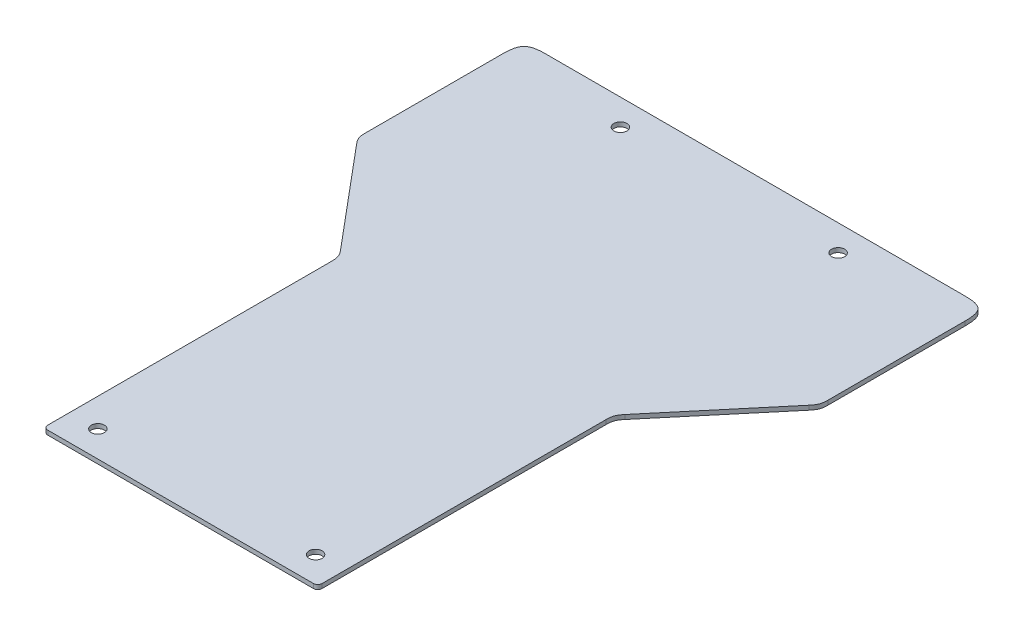
ISO-10303-21;
HEADER;
FILE_DESCRIPTION(('STEP AP214'),'2;1');
FILE_NAME('part.step','',(''),(''),'','','');
FILE_SCHEMA(('AUTOMOTIVE_DESIGN { 1 0 10303 214 1 1 1 1 }'));
ENDSEC;
DATA;
#1=APPLICATION_CONTEXT('core data for automotive mechanical design processes');
#2=APPLICATION_PROTOCOL_DEFINITION('international standard','automotive_design',2000,#1);
#3=PRODUCT_CONTEXT('',#1,'mechanical');
#4=PRODUCT('Part','Part','',(#3));
#5=PRODUCT_RELATED_PRODUCT_CATEGORY('part','',(#4));
#6=PRODUCT_DEFINITION_FORMATION('','',#4);
#7=PRODUCT_DEFINITION_CONTEXT('part definition',#1,'design');
#8=PRODUCT_DEFINITION('design','',#6,#7);
#9=PRODUCT_DEFINITION_SHAPE('','',#8);
#10=(LENGTH_UNIT() NAMED_UNIT(*) SI_UNIT(.MILLI.,.METRE.));
#11=(NAMED_UNIT(*) PLANE_ANGLE_UNIT() SI_UNIT($,.RADIAN.));
#12=(NAMED_UNIT(*) SI_UNIT($,.STERADIAN.) SOLID_ANGLE_UNIT());
#13=UNCERTAINTY_MEASURE_WITH_UNIT(LENGTH_MEASURE(1.E-05),#10,'distance_accuracy_value','');
#14=(GEOMETRIC_REPRESENTATION_CONTEXT(3) GLOBAL_UNCERTAINTY_ASSIGNED_CONTEXT((#13)) GLOBAL_UNIT_ASSIGNED_CONTEXT((#10,
#11,#12)) REPRESENTATION_CONTEXT('',''));
#15=CARTESIAN_POINT('',(0.,0.,0.));
#16=DIRECTION('',(0.,0.,1.));
#17=DIRECTION('',(1.,0.,0.));
#18=AXIS2_PLACEMENT_3D('',#15,#16,#17);
#19=CARTESIAN_POINT('',(-106.25,2.,56.));
#20=DIRECTION('',(-1.,0.,0.));
#21=DIRECTION('',(0.,0.,1.));
#22=AXIS2_PLACEMENT_3D('',#19,#20,#21);
#23=PLANE('',#22);
#24=DIRECTION('',(0.,0.,-1.));
#25=VECTOR('',#24,1.);
#26=CARTESIAN_POINT('',(-106.25,2.,56.));
#27=LINE('',#26,#25);
#28=CARTESIAN_POINT('',(-106.25,2.,14.8169547776392));
#29=VERTEX_POINT('',#28);
#30=CARTESIAN_POINT('',(-106.25,2.,-48.));
#31=VERTEX_POINT('',#30);
#32=EDGE_CURVE('E198',#29,#31,#27,.T.);
#33=ORIENTED_EDGE('',*,*,#32,.T.);
#34=CARTESIAN_POINT('',(-106.25,-0.1,-48.));
#35=CARTESIAN_POINT('',(-106.25,0.633333333333333,-48.));
#36=CARTESIAN_POINT('',(-106.25,1.36666666666667,-48.));
#37=CARTESIAN_POINT('',(-106.25,2.1,-48.));
#38=(BOUNDED_CURVE() B_SPLINE_CURVE(3,(#34,#35,#36,#37),.UNSPECIFIED.,.F.,
.F.) B_SPLINE_CURVE_WITH_KNOTS((4,4),(-9.99999999999998E-05,0.0021),
.UNSPECIFIED.) CURVE() GEOMETRIC_REPRESENTATION_ITEM() RATIONAL_B_SPLINE_CURVE((1.,1.,1.,1.)) REPRESENTATION_ITEM(''));
#39=CARTESIAN_POINT('',(-106.25,0.,-48.));
#40=VERTEX_POINT('',#39);
#41=EDGE_CURVE('E403',#31,#40,#38,.F.);
#42=ORIENTED_EDGE('',*,*,#41,.T.);
#43=DIRECTION('',(0.,0.,-1.));
#44=VECTOR('',#43,1.);
#45=CARTESIAN_POINT('',(-106.25,0.,56.));
#46=LINE('',#45,#44);
#47=CARTESIAN_POINT('',(-106.25,0.,14.8169547776392));
#48=VERTEX_POINT('',#47);
#49=EDGE_CURVE('E199',#48,#40,#46,.T.);
#50=ORIENTED_EDGE('',*,*,#49,.F.);
#51=CARTESIAN_POINT('',(-106.25,2.1,14.8169547776392));
#52=CARTESIAN_POINT('',(-106.25,1.36666666666667,14.8169547776392));
#53=CARTESIAN_POINT('',(-106.25,0.633333333333334,14.8169547776392));
#54=CARTESIAN_POINT('',(-106.25,-0.0999999999999998,14.8169547776392));
#55=(BOUNDED_CURVE() B_SPLINE_CURVE(3,(#51,#52,#53,#54),.UNSPECIFIED.,.F.,
.F.) B_SPLINE_CURVE_WITH_KNOTS((4,4),(-0.0021,9.99999999999998E-05),
.UNSPECIFIED.) CURVE() GEOMETRIC_REPRESENTATION_ITEM() RATIONAL_B_SPLINE_CURVE((1.,1.,1.,1.)) REPRESENTATION_ITEM(''));
#56=EDGE_CURVE('E619',#48,#29,#55,.F.);
#57=ORIENTED_EDGE('',*,*,#56,.T.);
#58=EDGE_LOOP('',(#33,#42,#50,#57));
#59=FACE_BOUND('',#58,.T.);
#60=ADVANCED_FACE('F49',(#59),#23,.T.);
#61=CARTESIAN_POINT('',(-134.25,2.,-58.));
#62=DIRECTION('',(0.,0.,-1.));
#63=DIRECTION('',(-1.,0.,0.));
#64=AXIS2_PLACEMENT_3D('',#61,#62,#63);
#65=PLANE('',#64);
#66=DIRECTION('',(1.,0.,0.));
#67=VECTOR('',#66,1.);
#68=CARTESIAN_POINT('',(-134.25,2.,-58.));
#69=LINE('',#68,#67);
#70=CARTESIAN_POINT('',(-96.25,2.,-58.));
#71=VERTEX_POINT('',#70);
#72=CARTESIAN_POINT('',(96.25,2.,-58.));
#73=VERTEX_POINT('',#72);
#74=EDGE_CURVE('E782',#71,#73,#69,.T.);
#75=ORIENTED_EDGE('',*,*,#74,.T.);
#76=CARTESIAN_POINT('',(96.25,-0.1,-58.));
#77=CARTESIAN_POINT('',(96.25,0.633333333333333,-58.));
#78=CARTESIAN_POINT('',(96.25,1.36666666666667,-58.));
#79=CARTESIAN_POINT('',(96.25,2.1,-58.));
#80=(BOUNDED_CURVE() B_SPLINE_CURVE(3,(#76,#77,#78,#79),.UNSPECIFIED.,.F.,
.F.) B_SPLINE_CURVE_WITH_KNOTS((4,4),(-9.99999999999998E-05,0.0021),
.UNSPECIFIED.) CURVE() GEOMETRIC_REPRESENTATION_ITEM() RATIONAL_B_SPLINE_CURVE((1.,1.,1.,1.)) REPRESENTATION_ITEM(''));
#81=CARTESIAN_POINT('',(96.25,0.,-58.));
#82=VERTEX_POINT('',#81);
#83=EDGE_CURVE('E686',#73,#82,#80,.F.);
#84=ORIENTED_EDGE('',*,*,#83,.T.);
#85=DIRECTION('',(1.,0.,0.));
#86=VECTOR('',#85,1.);
#87=CARTESIAN_POINT('',(-134.25,0.,-58.));
#88=LINE('',#87,#86);
#89=CARTESIAN_POINT('',(-96.25,0.,-58.));
#90=VERTEX_POINT('',#89);
#91=EDGE_CURVE('E784',#90,#82,#88,.T.);
#92=ORIENTED_EDGE('',*,*,#91,.F.);
#93=CARTESIAN_POINT('',(-96.25,2.1,-58.));
#94=CARTESIAN_POINT('',(-96.25,1.36666666666667,-58.));
#95=CARTESIAN_POINT('',(-96.25,0.633333333333333,-58.));
#96=CARTESIAN_POINT('',(-96.25,-0.1,-58.));
#97=(BOUNDED_CURVE() B_SPLINE_CURVE(3,(#93,#94,#95,#96),.UNSPECIFIED.,.F.,
.F.) B_SPLINE_CURVE_WITH_KNOTS((4,4),(-0.0001,0.0021),
.UNSPECIFIED.) CURVE() GEOMETRIC_REPRESENTATION_ITEM() RATIONAL_B_SPLINE_CURVE((1.,1.,1.,1.)) REPRESENTATION_ITEM(''));
#98=EDGE_CURVE('E426',#90,#71,#97,.F.);
#99=ORIENTED_EDGE('',*,*,#98,.T.);
#100=EDGE_LOOP('',(#75,#84,#92,#99));
#101=FACE_BOUND('',#100,.T.);
#102=ADVANCED_FACE('F715',(#101),#65,.T.);
#103=CARTESIAN_POINT('',(106.25,2.,-56.));
#104=DIRECTION('',(1.,0.,0.));
#105=DIRECTION('',(0.,1.,0.));
#106=AXIS2_PLACEMENT_3D('',#103,#104,#105);
#107=PLANE('',#106);
#108=DIRECTION('',(0.,0.,1.));
#109=VECTOR('',#108,1.);
#110=CARTESIAN_POINT('',(106.25,0.,56.));
#111=LINE('',#110,#109);
#112=CARTESIAN_POINT('',(106.25,0.,-48.));
#113=VERTEX_POINT('',#112);
#114=CARTESIAN_POINT('',(106.25,0.,14.8169547776392));
#115=VERTEX_POINT('',#114);
#116=EDGE_CURVE('E120',#113,#115,#111,.T.);
#117=ORIENTED_EDGE('',*,*,#116,.F.);
#118=CARTESIAN_POINT('',(106.25,2.1,-48.));
#119=CARTESIAN_POINT('',(106.25,1.36666666666667,-48.));
#120=CARTESIAN_POINT('',(106.25,0.633333333333333,-48.));
#121=CARTESIAN_POINT('',(106.25,-0.1,-48.));
#122=(BOUNDED_CURVE() B_SPLINE_CURVE(3,(#118,#119,#120,#121),.UNSPECIFIED.,.F.,
.F.) B_SPLINE_CURVE_WITH_KNOTS((4,4),(-0.0001,0.0021),
.UNSPECIFIED.) CURVE() GEOMETRIC_REPRESENTATION_ITEM() RATIONAL_B_SPLINE_CURVE((1.,1.,1.,1.)) REPRESENTATION_ITEM(''));
#123=CARTESIAN_POINT('',(106.25,2.,-48.));
#124=VERTEX_POINT('',#123);
#125=EDGE_CURVE('E375',#113,#124,#122,.F.);
#126=ORIENTED_EDGE('',*,*,#125,.T.);
#127=DIRECTION('',(0.,0.,1.));
#128=VECTOR('',#127,1.);
#129=CARTESIAN_POINT('',(106.25,2.,56.));
#130=LINE('',#129,#128);
#131=CARTESIAN_POINT('',(106.25,2.,14.8169547776392));
#132=VERTEX_POINT('',#131);
#133=EDGE_CURVE('E224',#124,#132,#130,.T.);
#134=ORIENTED_EDGE('',*,*,#133,.T.);
#135=CARTESIAN_POINT('',(106.25,-0.1,14.8169547776392));
#136=CARTESIAN_POINT('',(106.25,0.633333333333333,14.8169547776392));
#137=CARTESIAN_POINT('',(106.25,1.36666666666667,14.8169547776392));
#138=CARTESIAN_POINT('',(106.25,2.1,14.8169547776392));
#139=(BOUNDED_CURVE() B_SPLINE_CURVE(3,(#135,#136,#137,#138),.UNSPECIFIED.,.F.,
.F.) B_SPLINE_CURVE_WITH_KNOTS((4,4),(-9.99999999999998E-05,0.0021),
.UNSPECIFIED.) CURVE() GEOMETRIC_REPRESENTATION_ITEM() RATIONAL_B_SPLINE_CURVE((1.,1.,1.,1.)) REPRESENTATION_ITEM(''));
#140=EDGE_CURVE('E678',#132,#115,#139,.F.);
#141=ORIENTED_EDGE('',*,*,#140,.T.);
#142=EDGE_LOOP('',(#117,#126,#134,#141));
#143=FACE_BOUND('',#142,.T.);
#144=ADVANCED_FACE('F720',(#143),#107,.T.);
#145=CARTESIAN_POINT('',(63.,2.,98.));
#146=DIRECTION('',(1.,0.,0.));
#147=DIRECTION('',(0.,1.,0.));
#148=AXIS2_PLACEMENT_3D('',#145,#146,#147);
#149=PLANE('',#148);
#150=DIRECTION('',(0.,0.,1.));
#151=VECTOR('',#150,1.);
#152=CARTESIAN_POINT('',(63.,0.,98.));
#153=LINE('',#152,#151);
#154=CARTESIAN_POINT('',(63.,0.,73.6397023426624));
#155=VERTEX_POINT('',#154);
#156=CARTESIAN_POINT('',(63.,0.,204.));
#157=VERTEX_POINT('',#156);
#158=EDGE_CURVE('E108',#155,#157,#153,.T.);
#159=ORIENTED_EDGE('',*,*,#158,.F.);
#160=CARTESIAN_POINT('',(63.,2.1,73.6397023426624));
#161=CARTESIAN_POINT('',(63.,1.36666666666667,73.6397023426624));
#162=CARTESIAN_POINT('',(63.,0.633333333333333,73.6397023426624));
#163=CARTESIAN_POINT('',(63.,-0.1,73.6397023426624));
#164=(BOUNDED_CURVE() B_SPLINE_CURVE(3,(#160,#161,#162,#163),.UNSPECIFIED.,.F.,
.F.) B_SPLINE_CURVE_WITH_KNOTS((4,4),(-0.0001,0.0021),
.UNSPECIFIED.) CURVE() GEOMETRIC_REPRESENTATION_ITEM() RATIONAL_B_SPLINE_CURVE((1.,1.,1.,1.)) REPRESENTATION_ITEM(''));
#165=CARTESIAN_POINT('',(63.,2.,73.6397023426624));
#166=VERTEX_POINT('',#165);
#167=EDGE_CURVE('E511',#155,#166,#164,.F.);
#168=ORIENTED_EDGE('',*,*,#167,.T.);
#169=DIRECTION('',(0.,0.,1.));
#170=VECTOR('',#169,1.);
#171=CARTESIAN_POINT('',(63.,2.,98.));
#172=LINE('',#171,#170);
#173=CARTESIAN_POINT('',(63.,2.,204.));
#174=VERTEX_POINT('',#173);
#175=EDGE_CURVE('E99',#166,#174,#172,.T.);
#176=ORIENTED_EDGE('',*,*,#175,.T.);
#177=DIRECTION('',(0.,-1.,0.));
#178=VECTOR('',#177,1.);
#179=CARTESIAN_POINT('',(63.,2.,204.));
#180=LINE('',#179,#178);
#181=EDGE_CURVE('E122',#174,#157,#180,.T.);
#182=ORIENTED_EDGE('',*,*,#181,.T.);
#183=EDGE_LOOP('',(#159,#168,#176,#182));
#184=FACE_BOUND('',#183,.T.);
#185=ADVANCED_FACE('F123',(#184),#149,.T.);
#186=CARTESIAN_POINT('',(61.,2.,204.));
#187=DIRECTION('',(0.,-1.,0.));
#188=DIRECTION('',(0.,0.,-1.));
#189=AXIS2_PLACEMENT_3D('',#186,#187,#188);
#190=CYLINDRICAL_SURFACE('',#189,2.);
#191=CARTESIAN_POINT('',(61.,0.,204.));
#192=DIRECTION('',(0.,-1.,0.));
#193=DIRECTION('',(1.,0.,0.));
#194=AXIS2_PLACEMENT_3D('',#191,#192,#193);
#195=CIRCLE('',#194,2.);
#196=CARTESIAN_POINT('',(61.,0.,206.));
#197=VERTEX_POINT('',#196);
#198=EDGE_CURVE('E112',#157,#197,#195,.T.);
#199=ORIENTED_EDGE('',*,*,#198,.F.);
#200=ORIENTED_EDGE('',*,*,#181,.F.);
#201=CARTESIAN_POINT('',(61.,2.,204.));
#202=DIRECTION('',(0.,-1.,0.));
#203=DIRECTION('',(1.,0.,0.));
#204=AXIS2_PLACEMENT_3D('',#201,#202,#203);
#205=CIRCLE('',#204,2.);
#206=CARTESIAN_POINT('',(61.,2.,206.));
#207=VERTEX_POINT('',#206);
#208=EDGE_CURVE('E127',#174,#207,#205,.T.);
#209=ORIENTED_EDGE('',*,*,#208,.T.);
#210=DIRECTION('',(0.,-1.,0.));
#211=VECTOR('',#210,1.);
#212=CARTESIAN_POINT('',(61.,2.,206.));
#213=LINE('',#212,#211);
#214=EDGE_CURVE('E130',#207,#197,#213,.T.);
#215=ORIENTED_EDGE('',*,*,#214,.T.);
#216=EDGE_LOOP('',(#199,#200,#209,#215));
#217=FACE_BOUND('',#216,.T.);
#218=ADVANCED_FACE('F129',(#217),#190,.T.);
#219=CARTESIAN_POINT('',(61.,2.,206.));
#220=DIRECTION('',(0.,0.,1.));
#221=DIRECTION('',(1.,0.,0.));
#222=AXIS2_PLACEMENT_3D('',#219,#220,#221);
#223=PLANE('',#222);
#224=DIRECTION('',(-1.,0.,0.));
#225=VECTOR('',#224,1.);
#226=CARTESIAN_POINT('',(61.,0.,206.));
#227=LINE('',#226,#225);
#228=CARTESIAN_POINT('',(-61.,0.,206.));
#229=VERTEX_POINT('',#228);
#230=EDGE_CURVE('E132',#197,#229,#227,.T.);
#231=ORIENTED_EDGE('',*,*,#230,.F.);
#232=ORIENTED_EDGE('',*,*,#214,.F.);
#233=DIRECTION('',(-1.,0.,0.));
#234=VECTOR('',#233,1.);
#235=CARTESIAN_POINT('',(61.,2.,206.));
#236=LINE('',#235,#234);
#237=CARTESIAN_POINT('',(-61.,2.,206.));
#238=VERTEX_POINT('',#237);
#239=EDGE_CURVE('E149',#207,#238,#236,.T.);
#240=ORIENTED_EDGE('',*,*,#239,.T.);
#241=DIRECTION('',(0.,-1.,0.));
#242=VECTOR('',#241,1.);
#243=CARTESIAN_POINT('',(-61.,2.,206.));
#244=LINE('',#243,#242);
#245=EDGE_CURVE('E137',#238,#229,#244,.T.);
#246=ORIENTED_EDGE('',*,*,#245,.T.);
#247=EDGE_LOOP('',(#231,#232,#240,#246));
#248=FACE_BOUND('',#247,.T.);
#249=ADVANCED_FACE('F51',(#248),#223,.T.);
#250=CARTESIAN_POINT('',(-61.,2.,204.));
#251=DIRECTION('',(0.,-1.,0.));
#252=DIRECTION('',(0.,0.,-1.));
#253=AXIS2_PLACEMENT_3D('',#250,#251,#252);
#254=CYLINDRICAL_SURFACE('',#253,1.99999999999991);
#255=CARTESIAN_POINT('',(-61.,0.,204.));
#256=DIRECTION('',(0.,-1.,0.));
#257=DIRECTION('',(1.,0.,0.));
#258=AXIS2_PLACEMENT_3D('',#255,#256,#257);
#259=CIRCLE('',#258,1.99999999999991);
#260=CARTESIAN_POINT('',(-63.,0.,204.));
#261=VERTEX_POINT('',#260);
#262=EDGE_CURVE('E134',#229,#261,#259,.T.);
#263=ORIENTED_EDGE('',*,*,#262,.F.);
#264=ORIENTED_EDGE('',*,*,#245,.F.);
#265=CARTESIAN_POINT('',(-61.,2.,204.));
#266=DIRECTION('',(0.,-1.,0.));
#267=DIRECTION('',(1.,0.,0.));
#268=AXIS2_PLACEMENT_3D('',#265,#266,#267);
#269=CIRCLE('',#268,1.99999999999991);
#270=CARTESIAN_POINT('',(-63.,2.,204.));
#271=VERTEX_POINT('',#270);
#272=EDGE_CURVE('E145',#238,#271,#269,.T.);
#273=ORIENTED_EDGE('',*,*,#272,.T.);
#274=DIRECTION('',(0.,-1.,0.));
#275=VECTOR('',#274,1.);
#276=CARTESIAN_POINT('',(-63.,2.,204.));
#277=LINE('',#276,#275);
#278=EDGE_CURVE('E142',#271,#261,#277,.T.);
#279=ORIENTED_EDGE('',*,*,#278,.T.);
#280=EDGE_LOOP('',(#263,#264,#273,#279));
#281=FACE_BOUND('',#280,.T.);
#282=ADVANCED_FACE('F710',(#281),#254,.T.);
#283=CARTESIAN_POINT('',(-63.,2.,168.));
#284=DIRECTION('',(-1.,0.,0.));
#285=DIRECTION('',(0.,0.,1.));
#286=AXIS2_PLACEMENT_3D('',#283,#284,#285);
#287=PLANE('',#286);
#288=DIRECTION('',(0.,0.,-1.));
#289=VECTOR('',#288,1.);
#290=CARTESIAN_POINT('',(-63.,2.,168.));
#291=LINE('',#290,#289);
#292=CARTESIAN_POINT('',(-63.,2.,73.6397023426624));
#293=VERTEX_POINT('',#292);
#294=EDGE_CURVE('E146',#271,#293,#291,.T.);
#295=ORIENTED_EDGE('',*,*,#294,.T.);
#296=CARTESIAN_POINT('',(-63.,-0.0999999999999998,73.6397023426624));
#297=CARTESIAN_POINT('',(-63.,0.633333333333334,73.6397023426624));
#298=CARTESIAN_POINT('',(-63.,1.36666666666667,73.6397023426624));
#299=CARTESIAN_POINT('',(-63.,2.1,73.6397023426624));
#300=(BOUNDED_CURVE() B_SPLINE_CURVE(3,(#296,#297,#298,#299),.UNSPECIFIED.,.F.,
.F.) B_SPLINE_CURVE_WITH_KNOTS((4,4),(-0.0021,0.0001),
.UNSPECIFIED.) CURVE() GEOMETRIC_REPRESENTATION_ITEM() RATIONAL_B_SPLINE_CURVE((1.,1.,1.,1.)) REPRESENTATION_ITEM(''));
#301=CARTESIAN_POINT('',(-63.,0.,73.6397023426623));
#302=VERTEX_POINT('',#301);
#303=EDGE_CURVE('E654',#293,#302,#300,.F.);
#304=ORIENTED_EDGE('',*,*,#303,.T.);
#305=DIRECTION('',(0.,0.,-1.));
#306=VECTOR('',#305,1.);
#307=CARTESIAN_POINT('',(-63.,0.,168.));
#308=LINE('',#307,#306);
#309=EDGE_CURVE('E141',#261,#302,#308,.T.);
#310=ORIENTED_EDGE('',*,*,#309,.F.);
#311=ORIENTED_EDGE('',*,*,#278,.F.);
#312=EDGE_LOOP('',(#295,#304,#310,#311));
#313=FACE_BOUND('',#312,.T.);
#314=ADVANCED_FACE('F705',(#313),#287,.T.);
#315=CARTESIAN_POINT('',(-134.25,2.,56.));
#316=DIRECTION('',(0.,-1.,0.));
#317=DIRECTION('',(0.,0.,-1.));
#318=AXIS2_PLACEMENT_3D('',#315,#316,#317);
#319=PLANE('',#318);
#320=CARTESIAN_POINT('',(50.,2.,194.));
#321=DIRECTION('',(0.,1.,0.));
#322=DIRECTION('',(0.,0.,-1.));
#323=AXIS2_PLACEMENT_3D('',#320,#321,#322);
#324=CIRCLE('',#323,3.);
#325=CARTESIAN_POINT('',(50.,2.,191.));
#326=VERTEX_POINT('',#325);
#327=EDGE_CURVE('E53',#326,#326,#324,.T.);
#328=ORIENTED_EDGE('',*,*,#327,.F.);
#329=EDGE_LOOP('',(#328));
#330=FACE_BOUND('',#329,.T.);
#331=CARTESIAN_POINT('',(-50.,2.,-46.));
#332=DIRECTION('',(0.,1.,0.));
#333=DIRECTION('',(0.,0.,1.));
#334=AXIS2_PLACEMENT_3D('',#331,#332,#333);
#335=CIRCLE('',#334,3.);
#336=CARTESIAN_POINT('',(-50.,2.,-43.));
#337=VERTEX_POINT('',#336);
#338=EDGE_CURVE('E160',#337,#337,#335,.T.);
#339=ORIENTED_EDGE('',*,*,#338,.F.);
#340=EDGE_LOOP('',(#339));
#341=FACE_BOUND('',#340,.T.);
#342=CARTESIAN_POINT('',(50.,2.,-46.));
#343=DIRECTION('',(0.,1.,0.));
#344=DIRECTION('',(0.,0.,-1.));
#345=AXIS2_PLACEMENT_3D('',#342,#343,#344);
#346=CIRCLE('',#345,3.);
#347=CARTESIAN_POINT('',(50.,2.,-49.));
#348=VERTEX_POINT('',#347);
#349=EDGE_CURVE('E174',#348,#348,#346,.T.);
#350=ORIENTED_EDGE('',*,*,#349,.F.);
#351=EDGE_LOOP('',(#350));
#352=FACE_BOUND('',#351,.T.);
#353=CARTESIAN_POINT('',(-50.,2.,194.));
#354=DIRECTION('',(0.,1.,0.));
#355=DIRECTION('',(0.,0.,1.));
#356=AXIS2_PLACEMENT_3D('',#353,#354,#355);
#357=CIRCLE('',#356,3.);
#358=CARTESIAN_POINT('',(-50.,2.,197.));
#359=VERTEX_POINT('',#358);
#360=EDGE_CURVE('E156',#359,#359,#357,.T.);
#361=ORIENTED_EDGE('',*,*,#360,.F.);
#362=EDGE_LOOP('',(#361));
#363=FACE_BOUND('',#362,.T.);
#364=ORIENTED_EDGE('',*,*,#133,.F.);
#365=CARTESIAN_POINT('',(96.25,2.,-58.));
#366=CARTESIAN_POINT('',(106.25,2.,-58.));
#367=CARTESIAN_POINT('',(106.25,2.,-48.));
#368=(BOUNDED_CURVE() B_SPLINE_CURVE(2,(#365,#366,#367),.UNSPECIFIED.,.F.,
.F.) B_SPLINE_CURVE_WITH_KNOTS((3,3),(0.,1.),
.UNSPECIFIED.) CURVE() GEOMETRIC_REPRESENTATION_ITEM() RATIONAL_B_SPLINE_CURVE((1.,1.5,1.)) REPRESENTATION_ITEM(''));
#369=EDGE_CURVE('E663',#124,#73,#368,.F.);
#370=ORIENTED_EDGE('',*,*,#369,.T.);
#371=ORIENTED_EDGE('',*,*,#74,.F.);
#372=CARTESIAN_POINT('',(-106.25,2.,-48.));
#373=CARTESIAN_POINT('',(-106.25,2.,-58.));
#374=CARTESIAN_POINT('',(-96.25,2.,-58.));
#375=(BOUNDED_CURVE() B_SPLINE_CURVE(2,(#372,#373,#374),.UNSPECIFIED.,.F.,
.F.) B_SPLINE_CURVE_WITH_KNOTS((3,3),(0.,1.),
.UNSPECIFIED.) CURVE() GEOMETRIC_REPRESENTATION_ITEM() RATIONAL_B_SPLINE_CURVE((1.,1.5,1.)) REPRESENTATION_ITEM(''));
#376=EDGE_CURVE('E415',#71,#31,#375,.F.);
#377=ORIENTED_EDGE('',*,*,#376,.T.);
#378=ORIENTED_EDGE('',*,*,#32,.F.);
#379=CARTESIAN_POINT('',(-103.91044443119,2.,21.2448308745047));
#380=CARTESIAN_POINT('',(-106.25,2.,18.4566571203013));
#381=CARTESIAN_POINT('',(-106.25,2.,14.8169547776392));
#382=(BOUNDED_CURVE() B_SPLINE_CURVE(2,(#379,#380,#381),.UNSPECIFIED.,.F.,
.F.) B_SPLINE_CURVE_WITH_KNOTS((3,3),(0.,1.),
.UNSPECIFIED.) CURVE() GEOMETRIC_REPRESENTATION_ITEM() RATIONAL_B_SPLINE_CURVE((1.,1.5,1.)) REPRESENTATION_ITEM(''));
#383=CARTESIAN_POINT('',(-103.91044443119,2.,21.2448308745047));
#384=VERTEX_POINT('',#383);
#385=EDGE_CURVE('E608',#29,#384,#382,.F.);
#386=ORIENTED_EDGE('',*,*,#385,.T.);
#387=DIRECTION('',(-0.642787609686544,0.,-0.766044443118975));
#388=VECTOR('',#387,1.);
#389=CARTESIAN_POINT('',(-99.3324379417016,2.,26.7006865552717));
#390=LINE('',#389,#388);
#391=CARTESIAN_POINT('',(-65.3395555688102,2.,67.2118262457969));
#392=VERTEX_POINT('',#391);
#393=EDGE_CURVE('E197',#384,#392,#390,.F.);
#394=ORIENTED_EDGE('',*,*,#393,.T.);
#395=CARTESIAN_POINT('',(-63.,2.,73.6397023426624));
#396=CARTESIAN_POINT('',(-63.,2.,70.0000000000003));
#397=CARTESIAN_POINT('',(-65.3395555688103,2.,67.2118262457969));
#398=(BOUNDED_CURVE() B_SPLINE_CURVE(2,(#395,#396,#397),.UNSPECIFIED.,.F.,
.F.) B_SPLINE_CURVE_WITH_KNOTS((3,3),(0.,1.),
.UNSPECIFIED.) CURVE() GEOMETRIC_REPRESENTATION_ITEM() RATIONAL_B_SPLINE_CURVE((1.,1.5,1.)) REPRESENTATION_ITEM(''));
#399=EDGE_CURVE('E13',#392,#293,#398,.F.);
#400=ORIENTED_EDGE('',*,*,#399,.T.);
#401=ORIENTED_EDGE('',*,*,#294,.F.);
#402=ORIENTED_EDGE('',*,*,#272,.F.);
#403=ORIENTED_EDGE('',*,*,#239,.F.);
#404=ORIENTED_EDGE('',*,*,#208,.F.);
#405=ORIENTED_EDGE('',*,*,#175,.F.);
#406=CARTESIAN_POINT('',(65.3395555688103,2.,67.2118262457969));
#407=CARTESIAN_POINT('',(63.,2.,70.0000000000003));
#408=CARTESIAN_POINT('',(63.,2.,73.6397023426624));
#409=(BOUNDED_CURVE() B_SPLINE_CURVE(2,(#406,#407,#408),.UNSPECIFIED.,.F.,
.F.) B_SPLINE_CURVE_WITH_KNOTS((3,3),(0.,1.),
.UNSPECIFIED.) CURVE() GEOMETRIC_REPRESENTATION_ITEM() RATIONAL_B_SPLINE_CURVE((1.,1.5,1.)) REPRESENTATION_ITEM(''));
#410=CARTESIAN_POINT('',(65.3395555688103,2.,67.2118262457969));
#411=VERTEX_POINT('',#410);
#412=EDGE_CURVE('E501',#166,#411,#409,.F.);
#413=ORIENTED_EDGE('',*,*,#412,.T.);
#414=DIRECTION('',(-0.642787609686544,0.,0.766044443118975));
#415=VECTOR('',#414,1.);
#416=CARTESIAN_POINT('',(-11.6052942065144,2.,158.911127397161));
#417=LINE('',#416,#415);
#418=CARTESIAN_POINT('',(103.91044443119,2.,21.2448308745046));
#419=VERTEX_POINT('',#418);
#420=EDGE_CURVE('E225',#411,#419,#417,.F.);
#421=ORIENTED_EDGE('',*,*,#420,.T.);
#422=CARTESIAN_POINT('',(106.25,2.,14.8169547776392));
#423=CARTESIAN_POINT('',(106.25,2.,18.4566571203013));
#424=CARTESIAN_POINT('',(103.91044443119,2.,21.2448308745047));
#425=(BOUNDED_CURVE() B_SPLINE_CURVE(2,(#422,#423,#424),.UNSPECIFIED.,.F.,
.F.) B_SPLINE_CURVE_WITH_KNOTS((3,3),(0.,1.),
.UNSPECIFIED.) CURVE() GEOMETRIC_REPRESENTATION_ITEM() RATIONAL_B_SPLINE_CURVE((1.,1.5,1.)) REPRESENTATION_ITEM(''));
#426=EDGE_CURVE('E672',#419,#132,#425,.F.);
#427=ORIENTED_EDGE('',*,*,#426,.T.);
#428=EDGE_LOOP('',(#364,#370,#371,#377,#378,#386,#394,#400,#401,#402,#403,#404,#405,#413,#421,#427));
#429=FACE_BOUND('',#428,.T.);
#430=ADVANCED_FACE('F258',(#330,#341,#352,#363,#429),#319,.F.);
#431=CARTESIAN_POINT('',(-134.25,0.,56.));
#432=DIRECTION('',(0.,-1.,0.));
#433=DIRECTION('',(0.,0.,-1.));
#434=AXIS2_PLACEMENT_3D('',#431,#432,#433);
#435=PLANE('',#434);
#436=CARTESIAN_POINT('',(50.,0.,194.));
#437=DIRECTION('',(0.,-1.,0.));
#438=DIRECTION('',(0.,0.,-1.));
#439=AXIS2_PLACEMENT_3D('',#436,#437,#438);
#440=CIRCLE('',#439,3.);
#441=CARTESIAN_POINT('',(50.,0.,191.));
#442=VERTEX_POINT('',#441);
#443=EDGE_CURVE('E158',#442,#442,#440,.F.);
#444=ORIENTED_EDGE('',*,*,#443,.T.);
#445=EDGE_LOOP('',(#444));
#446=FACE_BOUND('',#445,.T.);
#447=CARTESIAN_POINT('',(-50.,0.,-46.));
#448=DIRECTION('',(0.,-1.,0.));
#449=DIRECTION('',(0.,0.,-1.));
#450=AXIS2_PLACEMENT_3D('',#447,#448,#449);
#451=CIRCLE('',#450,3.);
#452=CARTESIAN_POINT('',(-50.,0.,-49.));
#453=VERTEX_POINT('',#452);
#454=EDGE_CURVE('E166',#453,#453,#451,.F.);
#455=ORIENTED_EDGE('',*,*,#454,.T.);
#456=EDGE_LOOP('',(#455));
#457=FACE_BOUND('',#456,.T.);
#458=CARTESIAN_POINT('',(50.,0.,-46.));
#459=DIRECTION('',(0.,-1.,0.));
#460=DIRECTION('',(0.,0.,-1.));
#461=AXIS2_PLACEMENT_3D('',#458,#459,#460);
#462=CIRCLE('',#461,3.);
#463=CARTESIAN_POINT('',(50.,0.,-49.));
#464=VERTEX_POINT('',#463);
#465=EDGE_CURVE('E177',#464,#464,#462,.F.);
#466=ORIENTED_EDGE('',*,*,#465,.T.);
#467=EDGE_LOOP('',(#466));
#468=FACE_BOUND('',#467,.T.);
#469=CARTESIAN_POINT('',(-50.,0.,194.));
#470=DIRECTION('',(0.,-1.,0.));
#471=DIRECTION('',(0.,0.,-1.));
#472=AXIS2_PLACEMENT_3D('',#469,#470,#471);
#473=CIRCLE('',#472,3.);
#474=CARTESIAN_POINT('',(-50.,0.,191.));
#475=VERTEX_POINT('',#474);
#476=EDGE_CURVE('E153',#475,#475,#473,.F.);
#477=ORIENTED_EDGE('',*,*,#476,.T.);
#478=EDGE_LOOP('',(#477));
#479=FACE_BOUND('',#478,.T.);
#480=ORIENTED_EDGE('',*,*,#91,.T.);
#481=CARTESIAN_POINT('',(106.25,0.,-48.));
#482=CARTESIAN_POINT('',(106.25,0.,-58.));
#483=CARTESIAN_POINT('',(96.25,0.,-58.));
#484=(BOUNDED_CURVE() B_SPLINE_CURVE(2,(#481,#482,#483),.UNSPECIFIED.,.F.,
.F.) B_SPLINE_CURVE_WITH_KNOTS((3,3),(0.,1.),
.UNSPECIFIED.) CURVE() GEOMETRIC_REPRESENTATION_ITEM() RATIONAL_B_SPLINE_CURVE((1.,1.5,1.)) REPRESENTATION_ITEM(''));
#485=EDGE_CURVE('E320',#82,#113,#484,.F.);
#486=ORIENTED_EDGE('',*,*,#485,.T.);
#487=ORIENTED_EDGE('',*,*,#116,.T.);
#488=CARTESIAN_POINT('',(103.91044443119,0.,21.2448308745047));
#489=CARTESIAN_POINT('',(106.25,0.,18.4566571203013));
#490=CARTESIAN_POINT('',(106.25,0.,14.8169547776392));
#491=(BOUNDED_CURVE() B_SPLINE_CURVE(2,(#488,#489,#490),.UNSPECIFIED.,.F.,
.F.) B_SPLINE_CURVE_WITH_KNOTS((3,3),(0.,1.),
.UNSPECIFIED.) CURVE() GEOMETRIC_REPRESENTATION_ITEM() RATIONAL_B_SPLINE_CURVE((1.,1.5,1.)) REPRESENTATION_ITEM(''));
#492=CARTESIAN_POINT('',(103.91044443119,0.,21.2448308745047));
#493=VERTEX_POINT('',#492);
#494=EDGE_CURVE('E440',#115,#493,#491,.F.);
#495=ORIENTED_EDGE('',*,*,#494,.T.);
#496=DIRECTION('',(0.642787609686544,0.,-0.766044443118975));
#497=VECTOR('',#496,1.);
#498=CARTESIAN_POINT('',(106.633180821219,0.,18.));
#499=LINE('',#498,#497);
#500=CARTESIAN_POINT('',(65.3395555688103,0.,67.2118262457969));
#501=VERTEX_POINT('',#500);
#502=EDGE_CURVE('E216',#493,#501,#499,.F.);
#503=ORIENTED_EDGE('',*,*,#502,.T.);
#504=CARTESIAN_POINT('',(63.,0.,73.6397023426624));
#505=CARTESIAN_POINT('',(63.,0.,70.0000000000003));
#506=CARTESIAN_POINT('',(65.3395555688103,0.,67.2118262457969));
#507=(BOUNDED_CURVE() B_SPLINE_CURVE(2,(#504,#505,#506),.UNSPECIFIED.,.F.,
.F.) B_SPLINE_CURVE_WITH_KNOTS((3,3),(0.,1.),
.UNSPECIFIED.) CURVE() GEOMETRIC_REPRESENTATION_ITEM() RATIONAL_B_SPLINE_CURVE((1.,1.5,1.)) REPRESENTATION_ITEM(''));
#508=EDGE_CURVE('E117',#501,#155,#507,.F.);
#509=ORIENTED_EDGE('',*,*,#508,.T.);
#510=ORIENTED_EDGE('',*,*,#158,.T.);
#511=ORIENTED_EDGE('',*,*,#198,.T.);
#512=ORIENTED_EDGE('',*,*,#230,.T.);
#513=ORIENTED_EDGE('',*,*,#262,.T.);
#514=ORIENTED_EDGE('',*,*,#309,.T.);
#515=CARTESIAN_POINT('',(-65.3395555688103,0.,67.2118262457969));
#516=CARTESIAN_POINT('',(-63.,0.,70.0000000000003));
#517=CARTESIAN_POINT('',(-63.,0.,73.6397023426623));
#518=(BOUNDED_CURVE() B_SPLINE_CURVE(2,(#515,#516,#517),.UNSPECIFIED.,.F.,
.F.) B_SPLINE_CURVE_WITH_KNOTS((3,3),(0.,1.),
.UNSPECIFIED.) CURVE() GEOMETRIC_REPRESENTATION_ITEM() RATIONAL_B_SPLINE_CURVE((1.,1.5,1.)) REPRESENTATION_ITEM(''));
#519=CARTESIAN_POINT('',(-65.3395555688103,0.,67.2118262457969));
#520=VERTEX_POINT('',#519);
#521=EDGE_CURVE('E59',#302,#520,#518,.F.);
#522=ORIENTED_EDGE('',*,*,#521,.T.);
#523=DIRECTION('',(0.642787609686544,0.,0.766044443118975));
#524=VECTOR('',#523,1.);
#525=CARTESIAN_POINT('',(-63.,0.,70.0000000000003));
#526=LINE('',#525,#524);
#527=CARTESIAN_POINT('',(-103.91044443119,0.,21.2448308745046));
#528=VERTEX_POINT('',#527);
#529=EDGE_CURVE('E193',#520,#528,#526,.F.);
#530=ORIENTED_EDGE('',*,*,#529,.T.);
#531=CARTESIAN_POINT('',(-106.25,0.,14.8169547776392));
#532=CARTESIAN_POINT('',(-106.25,0.,18.4566571203013));
#533=CARTESIAN_POINT('',(-103.91044443119,0.,21.2448308745047));
#534=(BOUNDED_CURVE() B_SPLINE_CURVE(2,(#531,#532,#533),.UNSPECIFIED.,.F.,
.F.) B_SPLINE_CURVE_WITH_KNOTS((3,3),(0.,1.),
.UNSPECIFIED.) CURVE() GEOMETRIC_REPRESENTATION_ITEM() RATIONAL_B_SPLINE_CURVE((1.,1.5,1.)) REPRESENTATION_ITEM(''));
#535=EDGE_CURVE('E240',#528,#48,#534,.F.);
#536=ORIENTED_EDGE('',*,*,#535,.T.);
#537=ORIENTED_EDGE('',*,*,#49,.T.);
#538=CARTESIAN_POINT('',(-96.25,0.,-58.));
#539=CARTESIAN_POINT('',(-106.25,0.,-58.));
#540=CARTESIAN_POINT('',(-106.25,0.,-48.));
#541=(BOUNDED_CURVE() B_SPLINE_CURVE(2,(#538,#539,#540),.UNSPECIFIED.,.F.,
.F.) B_SPLINE_CURVE_WITH_KNOTS((3,3),(0.,1.),
.UNSPECIFIED.) CURVE() GEOMETRIC_REPRESENTATION_ITEM() RATIONAL_B_SPLINE_CURVE((1.,1.5,1.)) REPRESENTATION_ITEM(''));
#542=EDGE_CURVE('E390',#40,#90,#541,.F.);
#543=ORIENTED_EDGE('',*,*,#542,.T.);
#544=EDGE_LOOP('',(#480,#486,#487,#495,#503,#509,#510,#511,#512,#513,#514,#522,#530,#536,#537,#543));
#545=FACE_BOUND('',#544,.T.);
#546=ADVANCED_FACE('F110',(#446,#457,#468,#479,#545),#435,.T.);
#547=CARTESIAN_POINT('',(-50.,-0.00100000000000013,194.));
#548=DIRECTION('',(0.,1.,0.));
#549=DIRECTION('',(0.,0.,1.));
#550=AXIS2_PLACEMENT_3D('',#547,#548,#549);
#551=CYLINDRICAL_SURFACE('',#550,3.);
#552=ORIENTED_EDGE('',*,*,#476,.F.);
#553=EDGE_LOOP('',(#552));
#554=FACE_BOUND('',#553,.T.);
#555=ORIENTED_EDGE('',*,*,#360,.T.);
#556=EDGE_LOOP('',(#555));
#557=FACE_BOUND('',#556,.T.);
#558=ADVANCED_FACE('F257',(#554,#557),#551,.F.);
#559=CARTESIAN_POINT('',(50.,-0.00100000000000013,-46.));
#560=DIRECTION('',(0.,1.,0.));
#561=DIRECTION('',(0.,0.,1.));
#562=AXIS2_PLACEMENT_3D('',#559,#560,#561);
#563=CYLINDRICAL_SURFACE('',#562,3.);
#564=ORIENTED_EDGE('',*,*,#465,.F.);
#565=EDGE_LOOP('',(#564));
#566=FACE_BOUND('',#565,.T.);
#567=ORIENTED_EDGE('',*,*,#349,.T.);
#568=EDGE_LOOP('',(#567));
#569=FACE_BOUND('',#568,.T.);
#570=ADVANCED_FACE('F816',(#566,#569),#563,.F.);
#571=CARTESIAN_POINT('',(-50.,-0.00100000000000013,-46.));
#572=DIRECTION('',(0.,1.,0.));
#573=DIRECTION('',(0.,0.,1.));
#574=AXIS2_PLACEMENT_3D('',#571,#572,#573);
#575=CYLINDRICAL_SURFACE('',#574,3.);
#576=ORIENTED_EDGE('',*,*,#454,.F.);
#577=EDGE_LOOP('',(#576));
#578=FACE_BOUND('',#577,.T.);
#579=ORIENTED_EDGE('',*,*,#338,.T.);
#580=EDGE_LOOP('',(#579));
#581=FACE_BOUND('',#580,.T.);
#582=ADVANCED_FACE('F259',(#578,#581),#575,.F.);
#583=CARTESIAN_POINT('',(50.,-0.00100000000000013,194.));
#584=DIRECTION('',(0.,1.,0.));
#585=DIRECTION('',(0.,0.,1.));
#586=AXIS2_PLACEMENT_3D('',#583,#584,#585);
#587=CYLINDRICAL_SURFACE('',#586,3.);
#588=ORIENTED_EDGE('',*,*,#443,.F.);
#589=EDGE_LOOP('',(#588));
#590=FACE_BOUND('',#589,.T.);
#591=ORIENTED_EDGE('',*,*,#327,.T.);
#592=EDGE_LOOP('',(#591));
#593=FACE_BOUND('',#592,.T.);
#594=ADVANCED_FACE('F811',(#590,#593),#587,.F.);
#595=CARTESIAN_POINT('',(-63.,2.,70.0000000000003));
#596=DIRECTION('',(-0.766044443118974,0.,0.642787609686543));
#597=DIRECTION('',(0.,1.,0.));
#598=AXIS2_PLACEMENT_3D('',#595,#596,#597);
#599=PLANE('',#598);
#600=ORIENTED_EDGE('',*,*,#529,.F.);
#601=CARTESIAN_POINT('',(-65.3395555688103,2.1,67.2118262457969));
#602=CARTESIAN_POINT('',(-65.3395555688103,1.36666666666667,67.2118262457969));
#603=CARTESIAN_POINT('',(-65.3395555688103,0.633333333333334,67.2118262457969));
#604=CARTESIAN_POINT('',(-65.3395555688103,-0.0999999999999998,67.2118262457969));
#605=(BOUNDED_CURVE() B_SPLINE_CURVE(3,(#601,#602,#603,#604),.UNSPECIFIED.,.F.,
.F.) B_SPLINE_CURVE_WITH_KNOTS((4,4),(-0.0021,9.99999999999998E-05),
.UNSPECIFIED.) CURVE() GEOMETRIC_REPRESENTATION_ITEM() RATIONAL_B_SPLINE_CURVE((1.,1.,1.,1.)) REPRESENTATION_ITEM(''));
#606=EDGE_CURVE('E592',#520,#392,#605,.F.);
#607=ORIENTED_EDGE('',*,*,#606,.T.);
#608=ORIENTED_EDGE('',*,*,#393,.F.);
#609=CARTESIAN_POINT('',(-103.91044443119,-0.0999999999999998,21.2448308745047));
#610=CARTESIAN_POINT('',(-103.91044443119,0.633333333333334,21.2448308745047));
#611=CARTESIAN_POINT('',(-103.91044443119,1.36666666666667,21.2448308745047));
#612=CARTESIAN_POINT('',(-103.91044443119,2.1,21.2448308745047));
#613=(BOUNDED_CURVE() B_SPLINE_CURVE(3,(#609,#610,#611,#612),.UNSPECIFIED.,.F.,
.F.) B_SPLINE_CURVE_WITH_KNOTS((4,4),(-0.0021,0.0001),
.UNSPECIFIED.) CURVE() GEOMETRIC_REPRESENTATION_ITEM() RATIONAL_B_SPLINE_CURVE((1.,1.,1.,1.)) REPRESENTATION_ITEM(''));
#614=EDGE_CURVE('E641',#384,#528,#613,.F.);
#615=ORIENTED_EDGE('',*,*,#614,.T.);
#616=EDGE_LOOP('',(#600,#607,#608,#615));
#617=FACE_BOUND('',#616,.T.);
#618=ADVANCED_FACE('F701',(#617),#599,.T.);
#619=CARTESIAN_POINT('',(106.633180821219,2.,18.));
#620=DIRECTION('',(0.766044443118974,0.,0.642787609686543));
#621=DIRECTION('',(0.,1.,0.));
#622=AXIS2_PLACEMENT_3D('',#619,#620,#621);
#623=PLANE('',#622);
#624=ORIENTED_EDGE('',*,*,#502,.F.);
#625=CARTESIAN_POINT('',(103.91044443119,2.1,21.2448308745047));
#626=CARTESIAN_POINT('',(103.91044443119,1.36666666666667,21.2448308745047));
#627=CARTESIAN_POINT('',(103.91044443119,0.633333333333333,21.2448308745047));
#628=CARTESIAN_POINT('',(103.91044443119,-0.1,21.2448308745047));
#629=(BOUNDED_CURVE() B_SPLINE_CURVE(3,(#625,#626,#627,#628),.UNSPECIFIED.,.F.,
.F.) B_SPLINE_CURVE_WITH_KNOTS((4,4),(-0.0001,0.0021),
.UNSPECIFIED.) CURVE() GEOMETRIC_REPRESENTATION_ITEM() RATIONAL_B_SPLINE_CURVE((1.,1.,1.,1.)) REPRESENTATION_ITEM(''));
#630=EDGE_CURVE('E67',#493,#419,#629,.F.);
#631=ORIENTED_EDGE('',*,*,#630,.T.);
#632=ORIENTED_EDGE('',*,*,#420,.F.);
#633=CARTESIAN_POINT('',(65.3395555688103,-0.1,67.2118262457969));
#634=CARTESIAN_POINT('',(65.3395555688103,0.633333333333333,67.2118262457969));
#635=CARTESIAN_POINT('',(65.3395555688103,1.36666666666667,67.2118262457969));
#636=CARTESIAN_POINT('',(65.3395555688103,2.1,67.2118262457969));
#637=(BOUNDED_CURVE() B_SPLINE_CURVE(3,(#633,#634,#635,#636),.UNSPECIFIED.,.F.,
.F.) B_SPLINE_CURVE_WITH_KNOTS((4,4),(-9.99999999999998E-05,0.0021),
.UNSPECIFIED.) CURVE() GEOMETRIC_REPRESENTATION_ITEM() RATIONAL_B_SPLINE_CURVE((1.,1.,1.,1.)) REPRESENTATION_ITEM(''));
#638=EDGE_CURVE('E532',#411,#501,#637,.F.);
#639=ORIENTED_EDGE('',*,*,#638,.T.);
#640=EDGE_LOOP('',(#624,#631,#632,#639));
#641=FACE_BOUND('',#640,.T.);
#642=ADVANCED_FACE('F344',(#641),#623,.T.);
#643=CARTESIAN_POINT('',(96.25,2.1,-58.));
#644=CARTESIAN_POINT('',(96.25,1.36666666666667,-58.));
#645=CARTESIAN_POINT('',(96.25,0.633333333333333,-58.));
#646=CARTESIAN_POINT('',(96.25,-0.1,-58.));
#647=CARTESIAN_POINT('',(106.25,2.1,-58.));
#648=CARTESIAN_POINT('',(106.25,1.36666666666667,-58.));
#649=CARTESIAN_POINT('',(106.25,0.633333333333333,-58.));
#650=CARTESIAN_POINT('',(106.25,-0.1,-58.));
#651=CARTESIAN_POINT('',(106.25,2.1,-48.));
#652=CARTESIAN_POINT('',(106.25,1.36666666666667,-48.));
#653=CARTESIAN_POINT('',(106.25,0.633333333333333,-48.));
#654=CARTESIAN_POINT('',(106.25,-0.1,-48.));
#655=(BOUNDED_SURFACE() B_SPLINE_SURFACE(2,3,((#643,#644,#645,#646),(#647,#648,#649,#650),(#651,
#652,#653,#654)),.UNSPECIFIED.,.F.,.F.,.F.) B_SPLINE_SURFACE_WITH_KNOTS((3,3),(4,4),(0.,1.),
(-0.0001,0.0021),.UNSPECIFIED.) GEOMETRIC_REPRESENTATION_ITEM() RATIONAL_B_SPLINE_SURFACE(((1.,
1.,1.,1.),(1.5,1.5,1.5,1.5),(1.,1.,1.,1.))) REPRESENTATION_ITEM('') SURFACE());
#656=ORIENTED_EDGE('',*,*,#369,.F.);
#657=ORIENTED_EDGE('',*,*,#125,.F.);
#658=ORIENTED_EDGE('',*,*,#485,.F.);
#659=ORIENTED_EDGE('',*,*,#83,.F.);
#660=EDGE_LOOP('',(#656,#657,#658,#659));
#661=FACE_BOUND('',#660,.T.);
#662=ADVANCED_FACE('F328',(#661),#655,.T.);
#663=CARTESIAN_POINT('',(-106.25,2.1,-48.));
#664=CARTESIAN_POINT('',(-106.25,1.36666666666667,-48.));
#665=CARTESIAN_POINT('',(-106.25,0.633333333333333,-48.));
#666=CARTESIAN_POINT('',(-106.25,-0.1,-48.));
#667=CARTESIAN_POINT('',(-106.25,2.1,-58.));
#668=CARTESIAN_POINT('',(-106.25,1.36666666666667,-58.));
#669=CARTESIAN_POINT('',(-106.25,0.633333333333333,-58.));
#670=CARTESIAN_POINT('',(-106.25,-0.1,-58.));
#671=CARTESIAN_POINT('',(-96.25,2.1,-58.));
#672=CARTESIAN_POINT('',(-96.25,1.36666666666667,-58.));
#673=CARTESIAN_POINT('',(-96.25,0.633333333333333,-58.));
#674=CARTESIAN_POINT('',(-96.25,-0.1,-58.));
#675=(BOUNDED_SURFACE() B_SPLINE_SURFACE(2,3,((#663,#664,#665,#666),(#667,#668,#669,#670),(#671,
#672,#673,#674)),.UNSPECIFIED.,.F.,.F.,.F.) B_SPLINE_SURFACE_WITH_KNOTS((3,3),(4,4),(0.,1.),
(-0.0001,0.0021),.UNSPECIFIED.) GEOMETRIC_REPRESENTATION_ITEM() RATIONAL_B_SPLINE_SURFACE(((1.,
1.,1.,1.),(1.5,1.5,1.5,1.5),(1.,1.,1.,1.))) REPRESENTATION_ITEM('') SURFACE());
#676=ORIENTED_EDGE('',*,*,#376,.F.);
#677=ORIENTED_EDGE('',*,*,#98,.F.);
#678=ORIENTED_EDGE('',*,*,#542,.F.);
#679=ORIENTED_EDGE('',*,*,#41,.F.);
#680=EDGE_LOOP('',(#676,#677,#678,#679));
#681=FACE_BOUND('',#680,.T.);
#682=ADVANCED_FACE('F343',(#681),#675,.T.);
#683=CARTESIAN_POINT('',(106.25,2.1,14.8169547776392));
#684=CARTESIAN_POINT('',(106.25,1.36666666666667,14.8169547776392));
#685=CARTESIAN_POINT('',(106.25,0.633333333333333,14.8169547776392));
#686=CARTESIAN_POINT('',(106.25,-0.1,14.8169547776392));
#687=CARTESIAN_POINT('',(106.25,2.1,18.4566571203013));
#688=CARTESIAN_POINT('',(106.25,1.36666666666667,18.4566571203013));
#689=CARTESIAN_POINT('',(106.25,0.633333333333333,18.4566571203013));
#690=CARTESIAN_POINT('',(106.25,-0.1,18.4566571203013));
#691=CARTESIAN_POINT('',(103.91044443119,2.1,21.2448308745047));
#692=CARTESIAN_POINT('',(103.91044443119,1.36666666666667,21.2448308745047));
#693=CARTESIAN_POINT('',(103.91044443119,0.633333333333333,21.2448308745047));
#694=CARTESIAN_POINT('',(103.91044443119,-0.1,21.2448308745047));
#695=(BOUNDED_SURFACE() B_SPLINE_SURFACE(2,3,((#683,#684,#685,#686),(#687,#688,#689,#690),(#691,
#692,#693,#694)),.UNSPECIFIED.,.F.,.F.,.F.) B_SPLINE_SURFACE_WITH_KNOTS((3,3),(4,4),(0.,1.),
(-0.0001,0.0021),.UNSPECIFIED.) GEOMETRIC_REPRESENTATION_ITEM() RATIONAL_B_SPLINE_SURFACE(((1.,
1.,1.,1.),(1.5,1.5,1.5,1.5),(1.,1.,1.,1.))) REPRESENTATION_ITEM('') SURFACE());
#696=ORIENTED_EDGE('',*,*,#426,.F.);
#697=ORIENTED_EDGE('',*,*,#630,.F.);
#698=ORIENTED_EDGE('',*,*,#494,.F.);
#699=ORIENTED_EDGE('',*,*,#140,.F.);
#700=EDGE_LOOP('',(#696,#697,#698,#699));
#701=FACE_BOUND('',#700,.T.);
#702=ADVANCED_FACE('F447',(#701),#695,.T.);
#703=CARTESIAN_POINT('',(65.3395555688103,2.1,67.2118262457969));
#704=CARTESIAN_POINT('',(65.3395555688103,1.36666666666667,67.2118262457969));
#705=CARTESIAN_POINT('',(65.3395555688103,0.633333333333333,67.2118262457969));
#706=CARTESIAN_POINT('',(65.3395555688103,-0.1,67.2118262457969));
#707=CARTESIAN_POINT('',(63.,2.1,70.0000000000003));
#708=CARTESIAN_POINT('',(63.,1.36666666666667,70.0000000000003));
#709=CARTESIAN_POINT('',(63.,0.633333333333333,70.0000000000003));
#710=CARTESIAN_POINT('',(63.,-0.1,70.0000000000003));
#711=CARTESIAN_POINT('',(63.,2.1,73.6397023426624));
#712=CARTESIAN_POINT('',(63.,1.36666666666667,73.6397023426624));
#713=CARTESIAN_POINT('',(63.,0.633333333333333,73.6397023426624));
#714=CARTESIAN_POINT('',(63.,-0.1,73.6397023426624));
#715=(BOUNDED_SURFACE() B_SPLINE_SURFACE(2,3,((#703,#704,#705,#706),(#707,#708,#709,#710),(#711,
#712,#713,#714)),.UNSPECIFIED.,.F.,.F.,.F.) B_SPLINE_SURFACE_WITH_KNOTS((3,3),(4,4),(0.,1.),
(-0.0001,0.0021),.UNSPECIFIED.) GEOMETRIC_REPRESENTATION_ITEM() RATIONAL_B_SPLINE_SURFACE(((1.,
1.,1.,1.),(1.5,1.5,1.5,1.5),(1.,1.,1.,1.))) REPRESENTATION_ITEM('') SURFACE());
#716=ORIENTED_EDGE('',*,*,#508,.F.);
#717=ORIENTED_EDGE('',*,*,#638,.F.);
#718=ORIENTED_EDGE('',*,*,#412,.F.);
#719=ORIENTED_EDGE('',*,*,#167,.F.);
#720=EDGE_LOOP('',(#716,#717,#718,#719));
#721=FACE_BOUND('',#720,.T.);
#722=ADVANCED_FACE('F461',(#721),#715,.T.);
#723=CARTESIAN_POINT('',(-65.3395555688103,-0.0999999999999998,67.2118262457969));
#724=CARTESIAN_POINT('',(-65.3395555688103,0.633333333333334,67.2118262457969));
#725=CARTESIAN_POINT('',(-65.3395555688103,1.36666666666667,67.2118262457969));
#726=CARTESIAN_POINT('',(-65.3395555688103,2.1,67.2118262457969));
#727=CARTESIAN_POINT('',(-63.,-0.0999999999999998,70.0000000000003));
#728=CARTESIAN_POINT('',(-63.,0.633333333333334,70.0000000000003));
#729=CARTESIAN_POINT('',(-63.,1.36666666666667,70.0000000000003));
#730=CARTESIAN_POINT('',(-63.,2.1,70.0000000000003));
#731=CARTESIAN_POINT('',(-63.,-0.0999999999999998,73.6397023426624));
#732=CARTESIAN_POINT('',(-63.,0.633333333333334,73.6397023426624));
#733=CARTESIAN_POINT('',(-63.,1.36666666666667,73.6397023426624));
#734=CARTESIAN_POINT('',(-63.,2.1,73.6397023426624));
#735=(BOUNDED_SURFACE() B_SPLINE_SURFACE(2,3,((#723,#724,#725,#726),(#727,#728,#729,#730),(#731,
#732,#733,#734)),.UNSPECIFIED.,.F.,.F.,.F.) B_SPLINE_SURFACE_WITH_KNOTS((3,3),(4,4),(0.,1.),
(-0.0021,0.0001),.UNSPECIFIED.) GEOMETRIC_REPRESENTATION_ITEM() RATIONAL_B_SPLINE_SURFACE(((1.,
1.,1.,1.),(1.5,1.5,1.5,1.5),(1.,1.,1.,1.))) REPRESENTATION_ITEM('') SURFACE());
#736=ORIENTED_EDGE('',*,*,#399,.F.);
#737=ORIENTED_EDGE('',*,*,#606,.F.);
#738=ORIENTED_EDGE('',*,*,#521,.F.);
#739=ORIENTED_EDGE('',*,*,#303,.F.);
#740=EDGE_LOOP('',(#736,#737,#738,#739));
#741=FACE_BOUND('',#740,.T.);
#742=ADVANCED_FACE('F552',(#741),#735,.T.);
#743=CARTESIAN_POINT('',(-106.25,-0.0999999999999998,14.8169547776392));
#744=CARTESIAN_POINT('',(-106.25,0.633333333333334,14.8169547776392));
#745=CARTESIAN_POINT('',(-106.25,1.36666666666667,14.8169547776392));
#746=CARTESIAN_POINT('',(-106.25,2.1,14.8169547776392));
#747=CARTESIAN_POINT('',(-106.25,-0.0999999999999998,18.4566571203013));
#748=CARTESIAN_POINT('',(-106.25,0.633333333333334,18.4566571203013));
#749=CARTESIAN_POINT('',(-106.25,1.36666666666667,18.4566571203013));
#750=CARTESIAN_POINT('',(-106.25,2.1,18.4566571203013));
#751=CARTESIAN_POINT('',(-103.91044443119,-0.0999999999999998,21.2448308745047));
#752=CARTESIAN_POINT('',(-103.91044443119,0.633333333333334,21.2448308745047));
#753=CARTESIAN_POINT('',(-103.91044443119,1.36666666666667,21.2448308745047));
#754=CARTESIAN_POINT('',(-103.91044443119,2.1,21.2448308745047));
#755=(BOUNDED_SURFACE() B_SPLINE_SURFACE(2,3,((#743,#744,#745,#746),(#747,#748,#749,#750),(#751,
#752,#753,#754)),.UNSPECIFIED.,.F.,.F.,.F.) B_SPLINE_SURFACE_WITH_KNOTS((3,3),(4,4),(0.,1.),
(-0.0021,0.0001),.UNSPECIFIED.) GEOMETRIC_REPRESENTATION_ITEM() RATIONAL_B_SPLINE_SURFACE(((1.,
1.,1.,1.),(1.5,1.5,1.5,1.5),(1.,1.,1.,1.))) REPRESENTATION_ITEM('') SURFACE());
#756=ORIENTED_EDGE('',*,*,#535,.F.);
#757=ORIENTED_EDGE('',*,*,#614,.F.);
#758=ORIENTED_EDGE('',*,*,#385,.F.);
#759=ORIENTED_EDGE('',*,*,#56,.F.);
#760=EDGE_LOOP('',(#756,#757,#758,#759));
#761=FACE_BOUND('',#760,.T.);
#762=ADVANCED_FACE('F565',(#761),#755,.T.);
#763=CLOSED_SHELL('',(#60,#102,#144,#185,#218,#249,#282,#314,#430,#546,#558,#570,#582,#594,#618,
#642,#662,#682,#702,#722,#742,#762));
#764=MANIFOLD_SOLID_BREP('B2',#763);
#765=ADVANCED_BREP_SHAPE_REPRESENTATION('',(#18,#764),#14);
#766=SHAPE_DEFINITION_REPRESENTATION(#9,#765);
ENDSEC;
END-ISO-10303-21;
